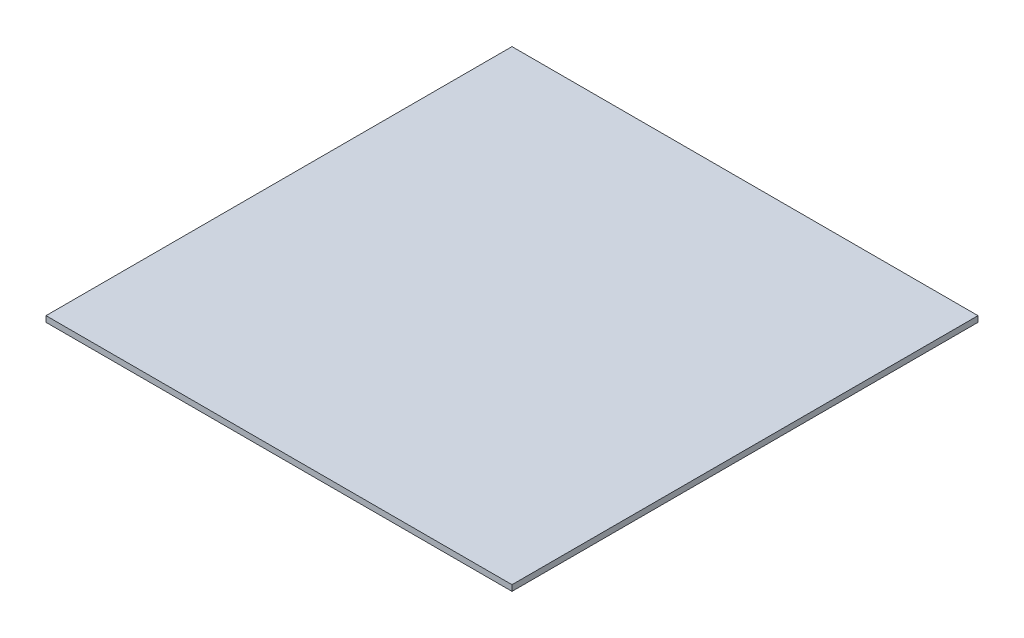
ISO-10303-21;
HEADER;
FILE_DESCRIPTION(('STEP AP214'),'2;1');
FILE_NAME('part.step','',(''),(''),'','','');
FILE_SCHEMA(('AUTOMOTIVE_DESIGN { 1 0 10303 214 1 1 1 1 }'));
ENDSEC;
DATA;
#1=APPLICATION_CONTEXT('core data for automotive mechanical design processes');
#2=APPLICATION_PROTOCOL_DEFINITION('international standard','automotive_design',2000,#1);
#3=PRODUCT_CONTEXT('',#1,'mechanical');
#4=PRODUCT('Part','Part','',(#3));
#5=PRODUCT_RELATED_PRODUCT_CATEGORY('part','',(#4));
#6=PRODUCT_DEFINITION_FORMATION('','',#4);
#7=PRODUCT_DEFINITION_CONTEXT('part definition',#1,'design');
#8=PRODUCT_DEFINITION('design','',#6,#7);
#9=PRODUCT_DEFINITION_SHAPE('','',#8);
#10=(LENGTH_UNIT() NAMED_UNIT(*) SI_UNIT(.MILLI.,.METRE.));
#11=(NAMED_UNIT(*) PLANE_ANGLE_UNIT() SI_UNIT($,.RADIAN.));
#12=(NAMED_UNIT(*) SI_UNIT($,.STERADIAN.) SOLID_ANGLE_UNIT());
#13=UNCERTAINTY_MEASURE_WITH_UNIT(LENGTH_MEASURE(1.E-05),#10,'distance_accuracy_value','');
#14=(GEOMETRIC_REPRESENTATION_CONTEXT(3) GLOBAL_UNCERTAINTY_ASSIGNED_CONTEXT((#13)) GLOBAL_UNIT_ASSIGNED_CONTEXT((#10,
#11,#12)) REPRESENTATION_CONTEXT('',''));
#15=CARTESIAN_POINT('',(0.,0.,0.));
#16=DIRECTION('',(0.,0.,1.));
#17=DIRECTION('',(1.,0.,0.));
#18=AXIS2_PLACEMENT_3D('',#15,#16,#17);
#19=CARTESIAN_POINT('',(0.,50.,0.));
#20=DIRECTION('',(1.,0.,0.));
#21=DIRECTION('',(0.,0.,-1.));
#22=AXIS2_PLACEMENT_3D('',#19,#20,#21);
#23=PLANE('',#22);
#24=DIRECTION('',(0.,0.,1.));
#25=VECTOR('',#24,1.);
#26=CARTESIAN_POINT('',(0.,0.,0.));
#27=LINE('',#26,#25);
#28=CARTESIAN_POINT('',(0.,0.,-4000.));
#29=VERTEX_POINT('',#28);
#30=CARTESIAN_POINT('',(0.,0.,0.));
#31=VERTEX_POINT('',#30);
#32=EDGE_CURVE('E100',#29,#31,#27,.T.);
#33=ORIENTED_EDGE('',*,*,#32,.T.);
#34=DIRECTION('',(0.,-1.,0.));
#35=VECTOR('',#34,1.);
#36=CARTESIAN_POINT('',(0.,50.,0.));
#37=LINE('',#36,#35);
#38=CARTESIAN_POINT('',(0.,50.,0.));
#39=VERTEX_POINT('',#38);
#40=EDGE_CURVE('E11',#39,#31,#37,.T.);
#41=ORIENTED_EDGE('',*,*,#40,.F.);
#42=DIRECTION('',(0.,0.,1.));
#43=VECTOR('',#42,1.);
#44=CARTESIAN_POINT('',(0.,50.,0.));
#45=LINE('',#44,#43);
#46=CARTESIAN_POINT('',(0.,50.,-4000.));
#47=VERTEX_POINT('',#46);
#48=EDGE_CURVE('E88',#47,#39,#45,.T.);
#49=ORIENTED_EDGE('',*,*,#48,.F.);
#50=DIRECTION('',(0.,-1.,0.));
#51=VECTOR('',#50,1.);
#52=CARTESIAN_POINT('',(0.,50.,-4000.));
#53=LINE('',#52,#51);
#54=EDGE_CURVE('E96',#47,#29,#53,.T.);
#55=ORIENTED_EDGE('',*,*,#54,.T.);
#56=EDGE_LOOP('',(#33,#41,#49,#55));
#57=FACE_BOUND('',#56,.T.);
#58=ADVANCED_FACE('F37',(#57),#23,.F.);
#59=CARTESIAN_POINT('',(0.,50.,0.));
#60=DIRECTION('',(0.,0.,-1.));
#61=DIRECTION('',(-1.,0.,0.));
#62=AXIS2_PLACEMENT_3D('',#59,#60,#61);
#63=PLANE('',#62);
#64=DIRECTION('',(1.,0.,0.));
#65=VECTOR('',#64,1.);
#66=CARTESIAN_POINT('',(0.,0.,0.));
#67=LINE('',#66,#65);
#68=CARTESIAN_POINT('',(4000.,0.,0.));
#69=VERTEX_POINT('',#68);
#70=EDGE_CURVE('E92',#31,#69,#67,.T.);
#71=ORIENTED_EDGE('',*,*,#70,.T.);
#72=DIRECTION('',(0.,-1.,0.));
#73=VECTOR('',#72,1.);
#74=CARTESIAN_POINT('',(4000.,50.,0.));
#75=LINE('',#74,#73);
#76=CARTESIAN_POINT('',(4000.,50.,0.));
#77=VERTEX_POINT('',#76);
#78=EDGE_CURVE('E45',#77,#69,#75,.T.);
#79=ORIENTED_EDGE('',*,*,#78,.F.);
#80=DIRECTION('',(1.,0.,0.));
#81=VECTOR('',#80,1.);
#82=CARTESIAN_POINT('',(0.,50.,0.));
#83=LINE('',#82,#81);
#84=EDGE_CURVE('E83',#39,#77,#83,.T.);
#85=ORIENTED_EDGE('',*,*,#84,.F.);
#86=ORIENTED_EDGE('',*,*,#40,.T.);
#87=EDGE_LOOP('',(#71,#79,#85,#86));
#88=FACE_BOUND('',#87,.T.);
#89=ADVANCED_FACE('F91',(#88),#63,.F.);
#90=CARTESIAN_POINT('',(4000.,50.,0.));
#91=DIRECTION('',(-1.,0.,0.));
#92=DIRECTION('',(0.,0.,1.));
#93=AXIS2_PLACEMENT_3D('',#90,#91,#92);
#94=PLANE('',#93);
#95=DIRECTION('',(0.,0.,-1.));
#96=VECTOR('',#95,1.);
#97=CARTESIAN_POINT('',(4000.,0.,0.));
#98=LINE('',#97,#96);
#99=CARTESIAN_POINT('',(4000.,0.,-4000.));
#100=VERTEX_POINT('',#99);
#101=EDGE_CURVE('E70',#69,#100,#98,.T.);
#102=ORIENTED_EDGE('',*,*,#101,.T.);
#103=DIRECTION('',(0.,-1.,0.));
#104=VECTOR('',#103,1.);
#105=CARTESIAN_POINT('',(4000.,50.,-4000.));
#106=LINE('',#105,#104);
#107=CARTESIAN_POINT('',(4000.,50.,-4000.));
#108=VERTEX_POINT('',#107);
#109=EDGE_CURVE('E93',#108,#100,#106,.T.);
#110=ORIENTED_EDGE('',*,*,#109,.F.);
#111=DIRECTION('',(0.,0.,-1.));
#112=VECTOR('',#111,1.);
#113=CARTESIAN_POINT('',(4000.,50.,0.));
#114=LINE('',#113,#112);
#115=EDGE_CURVE('E86',#77,#108,#114,.T.);
#116=ORIENTED_EDGE('',*,*,#115,.F.);
#117=ORIENTED_EDGE('',*,*,#78,.T.);
#118=EDGE_LOOP('',(#102,#110,#116,#117));
#119=FACE_BOUND('',#118,.T.);
#120=ADVANCED_FACE('F94',(#119),#94,.F.);
#121=CARTESIAN_POINT('',(0.,50.,-4000.));
#122=DIRECTION('',(0.,0.,1.));
#123=DIRECTION('',(1.,0.,0.));
#124=AXIS2_PLACEMENT_3D('',#121,#122,#123);
#125=PLANE('',#124);
#126=DIRECTION('',(-1.,0.,0.));
#127=VECTOR('',#126,1.);
#128=CARTESIAN_POINT('',(0.,0.,-4000.));
#129=LINE('',#128,#127);
#130=EDGE_CURVE('E76',#100,#29,#129,.T.);
#131=ORIENTED_EDGE('',*,*,#130,.T.);
#132=ORIENTED_EDGE('',*,*,#54,.F.);
#133=DIRECTION('',(-1.,0.,0.));
#134=VECTOR('',#133,1.);
#135=CARTESIAN_POINT('',(0.,50.,-4000.));
#136=LINE('',#135,#134);
#137=EDGE_CURVE('E53',#108,#47,#136,.T.);
#138=ORIENTED_EDGE('',*,*,#137,.F.);
#139=ORIENTED_EDGE('',*,*,#109,.T.);
#140=EDGE_LOOP('',(#131,#132,#138,#139));
#141=FACE_BOUND('',#140,.T.);
#142=ADVANCED_FACE('F107',(#141),#125,.F.);
#143=CARTESIAN_POINT('',(0.,50.,0.));
#144=DIRECTION('',(0.,-1.,0.));
#145=DIRECTION('',(0.,0.,-1.));
#146=AXIS2_PLACEMENT_3D('',#143,#144,#145);
#147=PLANE('',#146);
#148=ORIENTED_EDGE('',*,*,#48,.T.);
#149=ORIENTED_EDGE('',*,*,#84,.T.);
#150=ORIENTED_EDGE('',*,*,#115,.T.);
#151=ORIENTED_EDGE('',*,*,#137,.T.);
#152=EDGE_LOOP('',(#148,#149,#150,#151));
#153=FACE_BOUND('',#152,.T.);
#154=ADVANCED_FACE('F84',(#153),#147,.F.);
#155=CARTESIAN_POINT('',(0.,0.,0.));
#156=DIRECTION('',(0.,-1.,0.));
#157=DIRECTION('',(0.,0.,-1.));
#158=AXIS2_PLACEMENT_3D('',#155,#156,#157);
#159=PLANE('',#158);
#160=ORIENTED_EDGE('',*,*,#32,.F.);
#161=ORIENTED_EDGE('',*,*,#130,.F.);
#162=ORIENTED_EDGE('',*,*,#101,.F.);
#163=ORIENTED_EDGE('',*,*,#70,.F.);
#164=EDGE_LOOP('',(#160,#161,#162,#163));
#165=FACE_BOUND('',#164,.T.);
#166=ADVANCED_FACE('F110',(#165),#159,.T.);
#167=CLOSED_SHELL('',(#58,#89,#120,#142,#154,#166));
#168=MANIFOLD_SOLID_BREP('B2',#167);
#169=ADVANCED_BREP_SHAPE_REPRESENTATION('',(#18,#168),#14);
#170=SHAPE_DEFINITION_REPRESENTATION(#9,#169);
ENDSEC;
END-ISO-10303-21;
